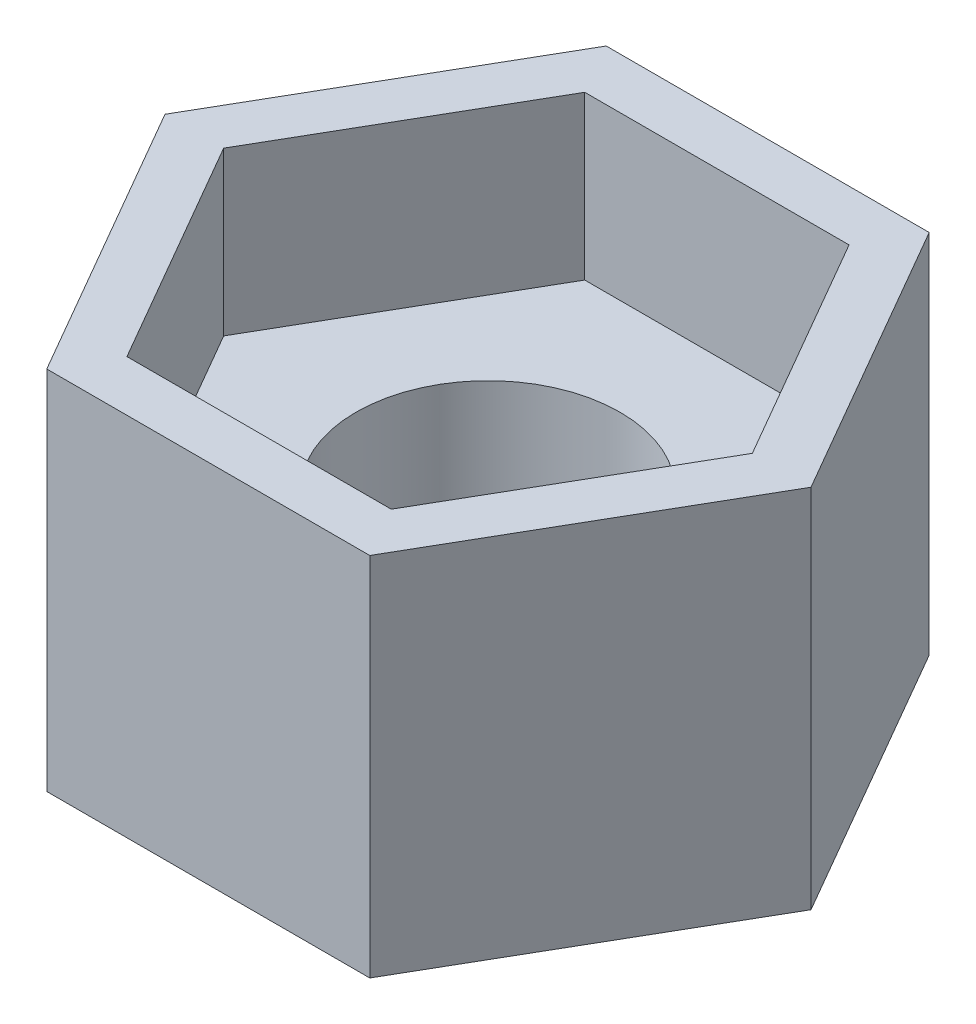
ISO-10303-21;
HEADER;
FILE_DESCRIPTION(('STEP AP214'),'2;1');
FILE_NAME('part.step','',(''),(''),'','','');
FILE_SCHEMA(('AUTOMOTIVE_DESIGN { 1 0 10303 214 1 1 1 1 }'));
ENDSEC;
DATA;
#1=APPLICATION_CONTEXT('core data for automotive mechanical design processes');
#2=APPLICATION_PROTOCOL_DEFINITION('international standard','automotive_design',2000,#1);
#3=PRODUCT_CONTEXT('',#1,'mechanical');
#4=PRODUCT('Part','Part','',(#3));
#5=PRODUCT_RELATED_PRODUCT_CATEGORY('part','',(#4));
#6=PRODUCT_DEFINITION_FORMATION('','',#4);
#7=PRODUCT_DEFINITION_CONTEXT('part definition',#1,'design');
#8=PRODUCT_DEFINITION('design','',#6,#7);
#9=PRODUCT_DEFINITION_SHAPE('','',#8);
#10=(LENGTH_UNIT() NAMED_UNIT(*) SI_UNIT(.MILLI.,.METRE.));
#11=(NAMED_UNIT(*) PLANE_ANGLE_UNIT() SI_UNIT($,.RADIAN.));
#12=(NAMED_UNIT(*) SI_UNIT($,.STERADIAN.) SOLID_ANGLE_UNIT());
#13=UNCERTAINTY_MEASURE_WITH_UNIT(LENGTH_MEASURE(1.E-05),#10,'distance_accuracy_value','');
#14=(GEOMETRIC_REPRESENTATION_CONTEXT(3) GLOBAL_UNCERTAINTY_ASSIGNED_CONTEXT((#13)) GLOBAL_UNIT_ASSIGNED_CONTEXT((#10,
#11,#12)) REPRESENTATION_CONTEXT('',''));
#15=CARTESIAN_POINT('',(0.,0.,0.));
#16=DIRECTION('',(0.,0.,1.));
#17=DIRECTION('',(1.,0.,0.));
#18=AXIS2_PLACEMENT_3D('',#15,#16,#17);
#19=CARTESIAN_POINT('',(0.,-1.,2.75205080756888));
#20=DIRECTION('',(0.,0.,1.));
#21=DIRECTION('',(1.,0.,0.));
#22=AXIS2_PLACEMENT_3D('',#19,#20,#21);
#23=PLANE('',#22);
#24=DIRECTION('',(0.,1.,0.));
#25=VECTOR('',#24,1.);
#26=CARTESIAN_POINT('',(1.58889727457342,-1.,2.75205080756888));
#27=LINE('',#26,#25);
#28=CARTESIAN_POINT('',(1.5888972745734,-2.,2.7520508075689));
#29=VERTEX_POINT('',#28);
#30=CARTESIAN_POINT('',(1.58889727457342,1.6,2.75205080756888));
#31=VERTEX_POINT('',#30);
#32=EDGE_CURVE('E219',#29,#31,#27,.T.);
#33=ORIENTED_EDGE('',*,*,#32,.T.);
#34=DIRECTION('',(1.,0.,0.));
#35=VECTOR('',#34,1.);
#36=CARTESIAN_POINT('',(0.,1.6,2.75205080756888));
#37=LINE('',#36,#35);
#38=CARTESIAN_POINT('',(-1.58889727457342,1.6,2.75205080756888));
#39=VERTEX_POINT('',#38);
#40=EDGE_CURVE('E180',#39,#31,#37,.T.);
#41=ORIENTED_EDGE('',*,*,#40,.F.);
#42=DIRECTION('',(0.,1.,0.));
#43=VECTOR('',#42,1.);
#44=CARTESIAN_POINT('',(-1.58889727457342,-1.,2.75205080756888));
#45=LINE('',#44,#43);
#46=CARTESIAN_POINT('',(-1.58889727457345,-2.,2.75205080756887));
#47=VERTEX_POINT('',#46);
#48=EDGE_CURVE('E11',#47,#39,#45,.T.);
#49=ORIENTED_EDGE('',*,*,#48,.F.);
#50=DIRECTION('',(-1.,0.,0.));
#51=VECTOR('',#50,1.);
#52=CARTESIAN_POINT('',(1.5888972745734,-2.,2.7520508075689));
#53=LINE('',#52,#51);
#54=EDGE_CURVE('E158',#29,#47,#53,.T.);
#55=ORIENTED_EDGE('',*,*,#54,.F.);
#56=EDGE_LOOP('',(#33,#41,#49,#55));
#57=FACE_BOUND('',#56,.T.);
#58=ADVANCED_FACE('F35',(#57),#23,.T.);
#59=CARTESIAN_POINT('',(-2.38334591186013,-1.,1.37602540378444));
#60=DIRECTION('',(-0.866025403784439,0.,0.5));
#61=DIRECTION('',(0.5,0.,0.866025403784439));
#62=AXIS2_PLACEMENT_3D('',#59,#60,#61);
#63=PLANE('',#62);
#64=ORIENTED_EDGE('',*,*,#48,.T.);
#65=DIRECTION('',(0.5,0.,0.866025403784439));
#66=VECTOR('',#65,1.);
#67=CARTESIAN_POINT('',(-2.38334591186013,1.6,1.37602540378444));
#68=LINE('',#67,#66);
#69=CARTESIAN_POINT('',(-3.17779454914684,1.6,0.));
#70=VERTEX_POINT('',#69);
#71=EDGE_CURVE('E192',#70,#39,#68,.T.);
#72=ORIENTED_EDGE('',*,*,#71,.F.);
#73=DIRECTION('',(0.,1.,0.));
#74=VECTOR('',#73,1.);
#75=CARTESIAN_POINT('',(-3.17779454914684,-1.,0.));
#76=LINE('',#75,#74);
#77=CARTESIAN_POINT('',(-3.17779454914685,-2.,0.));
#78=VERTEX_POINT('',#77);
#79=EDGE_CURVE('E43',#78,#70,#76,.T.);
#80=ORIENTED_EDGE('',*,*,#79,.F.);
#81=DIRECTION('',(-0.499999999999991,0.,-0.866025403784444));
#82=VECTOR('',#81,1.);
#83=CARTESIAN_POINT('',(-1.58889727457345,-2.,2.75205080756887));
#84=LINE('',#83,#82);
#85=EDGE_CURVE('E148',#47,#78,#84,.T.);
#86=ORIENTED_EDGE('',*,*,#85,.F.);
#87=EDGE_LOOP('',(#64,#72,#80,#86));
#88=FACE_BOUND('',#87,.T.);
#89=ADVANCED_FACE('F236',(#88),#63,.T.);
#90=CARTESIAN_POINT('',(-2.38334591186013,-1.,-1.37602540378444));
#91=DIRECTION('',(-0.866025403784439,0.,-0.5));
#92=DIRECTION('',(-0.5,0.,0.866025403784439));
#93=AXIS2_PLACEMENT_3D('',#90,#91,#92);
#94=PLANE('',#93);
#95=ORIENTED_EDGE('',*,*,#79,.T.);
#96=DIRECTION('',(-0.5,0.,0.866025403784439));
#97=VECTOR('',#96,1.);
#98=CARTESIAN_POINT('',(-2.38334591186013,1.6,-1.37602540378444));
#99=LINE('',#98,#97);
#100=CARTESIAN_POINT('',(-1.58889727457342,1.6,-2.75205080756889));
#101=VERTEX_POINT('',#100);
#102=EDGE_CURVE('E129',#101,#70,#99,.T.);
#103=ORIENTED_EDGE('',*,*,#102,.F.);
#104=DIRECTION('',(0.,1.,0.));
#105=VECTOR('',#104,1.);
#106=CARTESIAN_POINT('',(-1.58889727457342,-1.,-2.75205080756889));
#107=LINE('',#106,#105);
#108=CARTESIAN_POINT('',(-1.58889727457342,-2.,-2.75205080756889));
#109=VERTEX_POINT('',#108);
#110=EDGE_CURVE('E123',#109,#101,#107,.T.);
#111=ORIENTED_EDGE('',*,*,#110,.F.);
#112=DIRECTION('',(0.500000000000005,0.,-0.866025403784436));
#113=VECTOR('',#112,1.);
#114=CARTESIAN_POINT('',(-3.17779454914685,-2.,0.));
#115=LINE('',#114,#113);
#116=EDGE_CURVE('E127',#78,#109,#115,.T.);
#117=ORIENTED_EDGE('',*,*,#116,.F.);
#118=EDGE_LOOP('',(#95,#103,#111,#117));
#119=FACE_BOUND('',#118,.T.);
#120=ADVANCED_FACE('F125',(#119),#94,.T.);
#121=CARTESIAN_POINT('',(0.,-1.,-2.75205080756889));
#122=DIRECTION('',(0.,0.,-1.));
#123=DIRECTION('',(-1.,0.,0.));
#124=AXIS2_PLACEMENT_3D('',#121,#122,#123);
#125=PLANE('',#124);
#126=ORIENTED_EDGE('',*,*,#110,.T.);
#127=DIRECTION('',(-1.,0.,0.));
#128=VECTOR('',#127,1.);
#129=CARTESIAN_POINT('',(0.,1.6,-2.75205080756889));
#130=LINE('',#129,#128);
#131=CARTESIAN_POINT('',(1.58889727457342,1.6,-2.75205080756888));
#132=VERTEX_POINT('',#131);
#133=EDGE_CURVE('E189',#132,#101,#130,.T.);
#134=ORIENTED_EDGE('',*,*,#133,.F.);
#135=DIRECTION('',(0.,1.,0.));
#136=VECTOR('',#135,1.);
#137=CARTESIAN_POINT('',(1.58889727457342,-1.,-2.75205080756888));
#138=LINE('',#137,#136);
#139=CARTESIAN_POINT('',(1.58889727457343,-2.,-2.75205080756888));
#140=VERTEX_POINT('',#139);
#141=EDGE_CURVE('E133',#140,#132,#138,.T.);
#142=ORIENTED_EDGE('',*,*,#141,.F.);
#143=DIRECTION('',(1.,0.,0.));
#144=VECTOR('',#143,1.);
#145=CARTESIAN_POINT('',(-1.58889727457342,-2.,-2.75205080756889));
#146=LINE('',#145,#144);
#147=EDGE_CURVE('E136',#109,#140,#146,.T.);
#148=ORIENTED_EDGE('',*,*,#147,.F.);
#149=EDGE_LOOP('',(#126,#134,#142,#148));
#150=FACE_BOUND('',#149,.T.);
#151=ADVANCED_FACE('F137',(#150),#125,.T.);
#152=CARTESIAN_POINT('',(2.38334591186013,-1.,-1.37602540378444));
#153=DIRECTION('',(0.866025403784439,0.,-0.5));
#154=DIRECTION('',(-0.5,0.,-0.866025403784439));
#155=AXIS2_PLACEMENT_3D('',#152,#153,#154);
#156=PLANE('',#155);
#157=ORIENTED_EDGE('',*,*,#141,.T.);
#158=DIRECTION('',(-0.5,0.,-0.866025403784439));
#159=VECTOR('',#158,1.);
#160=CARTESIAN_POINT('',(2.38334591186013,1.6,-1.37602540378444));
#161=LINE('',#160,#159);
#162=CARTESIAN_POINT('',(3.17779454914684,1.6,0.));
#163=VERTEX_POINT('',#162);
#164=EDGE_CURVE('E186',#163,#132,#161,.T.);
#165=ORIENTED_EDGE('',*,*,#164,.F.);
#166=DIRECTION('',(0.,1.,0.));
#167=VECTOR('',#166,1.);
#168=CARTESIAN_POINT('',(3.17779454914684,-1.,0.));
#169=LINE('',#168,#167);
#170=CARTESIAN_POINT('',(3.17779454914685,-2.,0.));
#171=VERTEX_POINT('',#170);
#172=EDGE_CURVE('E223',#171,#163,#169,.T.);
#173=ORIENTED_EDGE('',*,*,#172,.F.);
#174=DIRECTION('',(0.499999999999997,0.,0.86602540378444));
#175=VECTOR('',#174,1.);
#176=CARTESIAN_POINT('',(1.58889727457343,-2.,-2.75205080756888));
#177=LINE('',#176,#175);
#178=EDGE_CURVE('E141',#140,#171,#177,.T.);
#179=ORIENTED_EDGE('',*,*,#178,.F.);
#180=EDGE_LOOP('',(#157,#165,#173,#179));
#181=FACE_BOUND('',#180,.T.);
#182=ADVANCED_FACE('F238',(#181),#156,.T.);
#183=CARTESIAN_POINT('',(2.38334591186013,-1.,1.37602540378444));
#184=DIRECTION('',(0.866025403784439,0.,0.5));
#185=DIRECTION('',(0.5,0.,-0.866025403784439));
#186=AXIS2_PLACEMENT_3D('',#183,#184,#185);
#187=PLANE('',#186);
#188=ORIENTED_EDGE('',*,*,#172,.T.);
#189=DIRECTION('',(0.5,0.,-0.866025403784439));
#190=VECTOR('',#189,1.);
#191=CARTESIAN_POINT('',(2.38334591186013,1.6,1.37602540378444));
#192=LINE('',#191,#190);
#193=EDGE_CURVE('E183',#31,#163,#192,.T.);
#194=ORIENTED_EDGE('',*,*,#193,.F.);
#195=ORIENTED_EDGE('',*,*,#32,.F.);
#196=DIRECTION('',(-0.500000000000005,0.,0.866025403784436));
#197=VECTOR('',#196,1.);
#198=CARTESIAN_POINT('',(3.17779454914685,-2.,0.));
#199=LINE('',#198,#197);
#200=EDGE_CURVE('E155',#171,#29,#199,.T.);
#201=ORIENTED_EDGE('',*,*,#200,.F.);
#202=EDGE_LOOP('',(#188,#194,#195,#201));
#203=FACE_BOUND('',#202,.T.);
#204=ADVANCED_FACE('F230',(#203),#187,.T.);
#205=CARTESIAN_POINT('',(0.,1.6,2.25205080756888));
#206=DIRECTION('',(0.,0.,-1.));
#207=DIRECTION('',(-1.,0.,0.));
#208=AXIS2_PLACEMENT_3D('',#205,#206,#207);
#209=PLANE('',#208);
#210=DIRECTION('',(1.,0.,0.));
#211=VECTOR('',#210,1.);
#212=CARTESIAN_POINT('',(0.,0.,2.25205080756888));
#213=LINE('',#212,#211);
#214=CARTESIAN_POINT('',(-1.30022213997861,0.,2.25205080756888));
#215=VERTEX_POINT('',#214);
#216=CARTESIAN_POINT('',(1.30022213997861,0.,2.25205080756888));
#217=VERTEX_POINT('',#216);
#218=EDGE_CURVE('E196',#215,#217,#213,.T.);
#219=ORIENTED_EDGE('',*,*,#218,.F.);
#220=DIRECTION('',(0.,-1.,0.));
#221=VECTOR('',#220,1.);
#222=CARTESIAN_POINT('',(-1.30022213997861,1.6,2.25205080756888));
#223=LINE('',#222,#221);
#224=CARTESIAN_POINT('',(-1.30022213997861,1.6,2.25205080756888));
#225=VERTEX_POINT('',#224);
#226=EDGE_CURVE('E218',#225,#215,#223,.T.);
#227=ORIENTED_EDGE('',*,*,#226,.F.);
#228=DIRECTION('',(1.,0.,0.));
#229=VECTOR('',#228,1.);
#230=CARTESIAN_POINT('',(0.,1.6,2.25205080756888));
#231=LINE('',#230,#229);
#232=CARTESIAN_POINT('',(1.30022213997861,1.6,2.25205080756888));
#233=VERTEX_POINT('',#232);
#234=EDGE_CURVE('E161',#225,#233,#231,.T.);
#235=ORIENTED_EDGE('',*,*,#234,.T.);
#236=DIRECTION('',(0.,-1.,0.));
#237=VECTOR('',#236,1.);
#238=CARTESIAN_POINT('',(1.30022213997861,1.6,2.25205080756888));
#239=LINE('',#238,#237);
#240=EDGE_CURVE('E195',#233,#217,#239,.T.);
#241=ORIENTED_EDGE('',*,*,#240,.T.);
#242=EDGE_LOOP('',(#219,#227,#235,#241));
#243=FACE_BOUND('',#242,.T.);
#244=ADVANCED_FACE('F245',(#243),#209,.T.);
#245=CARTESIAN_POINT('',(-1.95033320996791,1.6,1.12602540378444));
#246=DIRECTION('',(0.866025403784439,0.,-0.5));
#247=DIRECTION('',(-0.5,0.,-0.866025403784439));
#248=AXIS2_PLACEMENT_3D('',#245,#246,#247);
#249=PLANE('',#248);
#250=DIRECTION('',(0.5,0.,0.866025403784439));
#251=VECTOR('',#250,1.);
#252=CARTESIAN_POINT('',(-1.95033320996791,0.,1.12602540378444));
#253=LINE('',#252,#251);
#254=CARTESIAN_POINT('',(-2.60044427995722,0.,0.));
#255=VERTEX_POINT('',#254);
#256=EDGE_CURVE('E51',#255,#215,#253,.T.);
#257=ORIENTED_EDGE('',*,*,#256,.F.);
#258=DIRECTION('',(0.,-1.,0.));
#259=VECTOR('',#258,1.);
#260=CARTESIAN_POINT('',(-2.60044427995722,1.6,0.));
#261=LINE('',#260,#259);
#262=CARTESIAN_POINT('',(-2.60044427995722,1.6,0.));
#263=VERTEX_POINT('',#262);
#264=EDGE_CURVE('E216',#263,#255,#261,.T.);
#265=ORIENTED_EDGE('',*,*,#264,.F.);
#266=DIRECTION('',(0.5,0.,0.866025403784439));
#267=VECTOR('',#266,1.);
#268=CARTESIAN_POINT('',(-1.95033320996791,1.6,1.12602540378444));
#269=LINE('',#268,#267);
#270=EDGE_CURVE('E164',#263,#225,#269,.T.);
#271=ORIENTED_EDGE('',*,*,#270,.T.);
#272=ORIENTED_EDGE('',*,*,#226,.T.);
#273=EDGE_LOOP('',(#257,#265,#271,#272));
#274=FACE_BOUND('',#273,.T.);
#275=ADVANCED_FACE('F264',(#274),#249,.T.);
#276=CARTESIAN_POINT('',(-1.95033320996791,1.6,-1.12602540378444));
#277=DIRECTION('',(0.866025403784439,0.,0.5));
#278=DIRECTION('',(0.5,0.,-0.866025403784439));
#279=AXIS2_PLACEMENT_3D('',#276,#277,#278);
#280=PLANE('',#279);
#281=DIRECTION('',(-0.5,0.,0.866025403784439));
#282=VECTOR('',#281,1.);
#283=CARTESIAN_POINT('',(-1.95033320996791,0.,-1.12602540378444));
#284=LINE('',#283,#282);
#285=CARTESIAN_POINT('',(-1.30022213997861,0.,-2.25205080756888));
#286=VERTEX_POINT('',#285);
#287=EDGE_CURVE('E56',#286,#255,#284,.T.);
#288=ORIENTED_EDGE('',*,*,#287,.F.);
#289=DIRECTION('',(0.,-1.,0.));
#290=VECTOR('',#289,1.);
#291=CARTESIAN_POINT('',(-1.30022213997861,1.6,-2.25205080756888));
#292=LINE('',#291,#290);
#293=CARTESIAN_POINT('',(-1.30022213997861,1.6,-2.25205080756888));
#294=VERTEX_POINT('',#293);
#295=EDGE_CURVE('E213',#294,#286,#292,.T.);
#296=ORIENTED_EDGE('',*,*,#295,.F.);
#297=DIRECTION('',(-0.5,0.,0.866025403784439));
#298=VECTOR('',#297,1.);
#299=CARTESIAN_POINT('',(-1.95033320996791,1.6,-1.12602540378444));
#300=LINE('',#299,#298);
#301=EDGE_CURVE('E168',#294,#263,#300,.T.);
#302=ORIENTED_EDGE('',*,*,#301,.T.);
#303=ORIENTED_EDGE('',*,*,#264,.T.);
#304=EDGE_LOOP('',(#288,#296,#302,#303));
#305=FACE_BOUND('',#304,.T.);
#306=ADVANCED_FACE('F268',(#305),#280,.T.);
#307=CARTESIAN_POINT('',(0.,1.6,-2.25205080756888));
#308=DIRECTION('',(0.,0.,1.));
#309=DIRECTION('',(1.,0.,0.));
#310=AXIS2_PLACEMENT_3D('',#307,#308,#309);
#311=PLANE('',#310);
#312=DIRECTION('',(-1.,0.,0.));
#313=VECTOR('',#312,1.);
#314=CARTESIAN_POINT('',(0.,0.,-2.25205080756888));
#315=LINE('',#314,#313);
#316=CARTESIAN_POINT('',(1.30022213997861,0.,-2.25205080756888));
#317=VERTEX_POINT('',#316);
#318=EDGE_CURVE('E200',#317,#286,#315,.T.);
#319=ORIENTED_EDGE('',*,*,#318,.F.);
#320=DIRECTION('',(0.,-1.,0.));
#321=VECTOR('',#320,1.);
#322=CARTESIAN_POINT('',(1.30022213997861,1.6,-2.25205080756888));
#323=LINE('',#322,#321);
#324=CARTESIAN_POINT('',(1.30022213997861,1.6,-2.25205080756888));
#325=VERTEX_POINT('',#324);
#326=EDGE_CURVE('E210',#325,#317,#323,.T.);
#327=ORIENTED_EDGE('',*,*,#326,.F.);
#328=DIRECTION('',(-1.,0.,0.));
#329=VECTOR('',#328,1.);
#330=CARTESIAN_POINT('',(0.,1.6,-2.25205080756888));
#331=LINE('',#330,#329);
#332=EDGE_CURVE('E171',#325,#294,#331,.T.);
#333=ORIENTED_EDGE('',*,*,#332,.T.);
#334=ORIENTED_EDGE('',*,*,#295,.T.);
#335=EDGE_LOOP('',(#319,#327,#333,#334));
#336=FACE_BOUND('',#335,.T.);
#337=ADVANCED_FACE('F272',(#336),#311,.T.);
#338=CARTESIAN_POINT('',(1.95033320996791,1.6,-1.12602540378444));
#339=DIRECTION('',(-0.866025403784438,0.,0.5));
#340=DIRECTION('',(0.5,0.,0.866025403784439));
#341=AXIS2_PLACEMENT_3D('',#338,#339,#340);
#342=PLANE('',#341);
#343=DIRECTION('',(-0.5,0.,-0.866025403784439));
#344=VECTOR('',#343,1.);
#345=CARTESIAN_POINT('',(1.95033320996791,0.,-1.12602540378444));
#346=LINE('',#345,#344);
#347=CARTESIAN_POINT('',(2.60044427995722,0.,0.));
#348=VERTEX_POINT('',#347);
#349=EDGE_CURVE('E202',#348,#317,#346,.T.);
#350=ORIENTED_EDGE('',*,*,#349,.F.);
#351=DIRECTION('',(0.,-1.,0.));
#352=VECTOR('',#351,1.);
#353=CARTESIAN_POINT('',(2.60044427995722,1.6,0.));
#354=LINE('',#353,#352);
#355=CARTESIAN_POINT('',(2.60044427995722,1.6,0.));
#356=VERTEX_POINT('',#355);
#357=EDGE_CURVE('E207',#356,#348,#354,.T.);
#358=ORIENTED_EDGE('',*,*,#357,.F.);
#359=DIRECTION('',(-0.5,0.,-0.866025403784439));
#360=VECTOR('',#359,1.);
#361=CARTESIAN_POINT('',(1.95033320996791,1.6,-1.12602540378444));
#362=LINE('',#361,#360);
#363=EDGE_CURVE('E174',#356,#325,#362,.T.);
#364=ORIENTED_EDGE('',*,*,#363,.T.);
#365=ORIENTED_EDGE('',*,*,#326,.T.);
#366=EDGE_LOOP('',(#350,#358,#364,#365));
#367=FACE_BOUND('',#366,.T.);
#368=ADVANCED_FACE('F276',(#367),#342,.T.);
#369=CARTESIAN_POINT('',(1.95033320996791,1.6,1.12602540378444));
#370=DIRECTION('',(-0.866025403784439,0.,-0.5));
#371=DIRECTION('',(-0.5,0.,0.866025403784439));
#372=AXIS2_PLACEMENT_3D('',#369,#370,#371);
#373=PLANE('',#372);
#374=DIRECTION('',(0.5,0.,-0.866025403784439));
#375=VECTOR('',#374,1.);
#376=CARTESIAN_POINT('',(1.95033320996791,0.,1.12602540378444));
#377=LINE('',#376,#375);
#378=EDGE_CURVE('E165',#217,#348,#377,.T.);
#379=ORIENTED_EDGE('',*,*,#378,.F.);
#380=ORIENTED_EDGE('',*,*,#240,.F.);
#381=DIRECTION('',(0.5,0.,-0.866025403784439));
#382=VECTOR('',#381,1.);
#383=CARTESIAN_POINT('',(1.95033320996791,1.6,1.12602540378444));
#384=LINE('',#383,#382);
#385=EDGE_CURVE('E177',#233,#356,#384,.T.);
#386=ORIENTED_EDGE('',*,*,#385,.T.);
#387=ORIENTED_EDGE('',*,*,#357,.T.);
#388=EDGE_LOOP('',(#379,#380,#386,#387));
#389=FACE_BOUND('',#388,.T.);
#390=ADVANCED_FACE('F280',(#389),#373,.T.);
#391=CARTESIAN_POINT('',(0.,1.6,0.));
#392=DIRECTION('',(0.,1.,0.));
#393=DIRECTION('',(0.,0.,1.));
#394=AXIS2_PLACEMENT_3D('',#391,#392,#393);
#395=PLANE('',#394);
#396=ORIENTED_EDGE('',*,*,#234,.F.);
#397=ORIENTED_EDGE('',*,*,#270,.F.);
#398=ORIENTED_EDGE('',*,*,#301,.F.);
#399=ORIENTED_EDGE('',*,*,#332,.F.);
#400=ORIENTED_EDGE('',*,*,#363,.F.);
#401=ORIENTED_EDGE('',*,*,#385,.F.);
#402=EDGE_LOOP('',(#396,#397,#398,#399,#400,#401));
#403=FACE_BOUND('',#402,.T.);
#404=ORIENTED_EDGE('',*,*,#40,.T.);
#405=ORIENTED_EDGE('',*,*,#193,.T.);
#406=ORIENTED_EDGE('',*,*,#164,.T.);
#407=ORIENTED_EDGE('',*,*,#133,.T.);
#408=ORIENTED_EDGE('',*,*,#102,.T.);
#409=ORIENTED_EDGE('',*,*,#71,.T.);
#410=EDGE_LOOP('',(#404,#405,#406,#407,#408,#409));
#411=FACE_BOUND('',#410,.T.);
#412=ADVANCED_FACE('F233',(#403,#411),#395,.T.);
#413=CARTESIAN_POINT('',(0.,0.,0.));
#414=DIRECTION('',(0.,1.,0.));
#415=DIRECTION('',(0.,0.,1.));
#416=AXIS2_PLACEMENT_3D('',#413,#414,#415);
#417=PLANE('',#416);
#418=CARTESIAN_POINT('',(0.,0.,0.));
#419=DIRECTION('',(0.,1.,0.));
#420=DIRECTION('',(0.,0.,1.));
#421=AXIS2_PLACEMENT_3D('',#418,#419,#420);
#422=CIRCLE('',#421,1.3);
#423=CARTESIAN_POINT('',(0.,0.,1.3));
#424=VERTEX_POINT('',#423);
#425=EDGE_CURVE('E38',#424,#424,#422,.T.);
#426=ORIENTED_EDGE('',*,*,#425,.F.);
#427=EDGE_LOOP('',(#426));
#428=FACE_BOUND('',#427,.T.);
#429=ORIENTED_EDGE('',*,*,#218,.T.);
#430=ORIENTED_EDGE('',*,*,#378,.T.);
#431=ORIENTED_EDGE('',*,*,#349,.T.);
#432=ORIENTED_EDGE('',*,*,#318,.T.);
#433=ORIENTED_EDGE('',*,*,#287,.T.);
#434=ORIENTED_EDGE('',*,*,#256,.T.);
#435=EDGE_LOOP('',(#429,#430,#431,#432,#433,#434));
#436=FACE_BOUND('',#435,.T.);
#437=ADVANCED_FACE('F258',(#428,#436),#417,.T.);
#438=CARTESIAN_POINT('',(0.,1.6,0.));
#439=DIRECTION('',(0.,-1.,0.));
#440=DIRECTION('',(0.,0.,-1.));
#441=AXIS2_PLACEMENT_3D('',#438,#439,#440);
#442=CYLINDRICAL_SURFACE('',#441,1.3);
#443=ORIENTED_EDGE('',*,*,#425,.T.);
#444=EDGE_LOOP('',(#443));
#445=FACE_BOUND('',#444,.T.);
#446=CARTESIAN_POINT('',(0.,-2.,0.));
#447=DIRECTION('',(0.,-1.,0.));
#448=DIRECTION('',(0.,0.,-1.));
#449=AXIS2_PLACEMENT_3D('',#446,#447,#448);
#450=CIRCLE('',#449,1.3);
#451=CARTESIAN_POINT('',(0.,-2.,-1.3));
#452=VERTEX_POINT('',#451);
#453=EDGE_CURVE('E149',#452,#452,#450,.T.);
#454=ORIENTED_EDGE('',*,*,#453,.T.);
#455=EDGE_LOOP('',(#454));
#456=FACE_BOUND('',#455,.T.);
#457=ADVANCED_FACE('F260',(#445,#456),#442,.F.);
#458=CARTESIAN_POINT('',(0.,-2.,0.));
#459=DIRECTION('',(0.,-1.,0.));
#460=DIRECTION('',(0.,0.,-1.));
#461=AXIS2_PLACEMENT_3D('',#458,#459,#460);
#462=PLANE('',#461);
#463=ORIENTED_EDGE('',*,*,#116,.T.);
#464=ORIENTED_EDGE('',*,*,#147,.T.);
#465=ORIENTED_EDGE('',*,*,#178,.T.);
#466=ORIENTED_EDGE('',*,*,#200,.T.);
#467=ORIENTED_EDGE('',*,*,#54,.T.);
#468=ORIENTED_EDGE('',*,*,#85,.T.);
#469=EDGE_LOOP('',(#463,#464,#465,#466,#467,#468));
#470=FACE_BOUND('',#469,.T.);
#471=ORIENTED_EDGE('',*,*,#453,.F.);
#472=EDGE_LOOP('',(#471));
#473=FACE_BOUND('',#472,.T.);
#474=ADVANCED_FACE('F144',(#470,#473),#462,.T.);
#475=CLOSED_SHELL('',(#58,#89,#120,#151,#182,#204,#244,#275,#306,#337,#368,#390,#412,#437,#457,#474));
#476=MANIFOLD_SOLID_BREP('B2',#475);
#477=ADVANCED_BREP_SHAPE_REPRESENTATION('',(#18,#476),#14);
#478=SHAPE_DEFINITION_REPRESENTATION(#9,#477);
ENDSEC;
END-ISO-10303-21;
